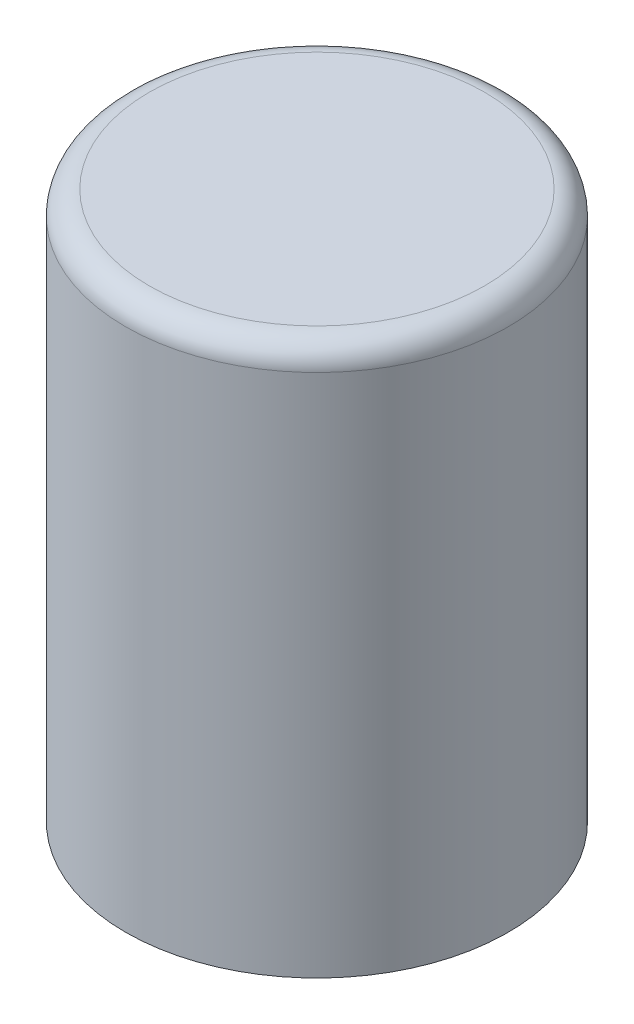
ISO-10303-21;
HEADER;
FILE_DESCRIPTION(('STEP AP214'),'2;1');
FILE_NAME('part.step','',(''),(''),'','','');
FILE_SCHEMA(('AUTOMOTIVE_DESIGN { 1 0 10303 214 1 1 1 1 }'));
ENDSEC;
DATA;
#1=APPLICATION_CONTEXT('core data for automotive mechanical design processes');
#2=APPLICATION_PROTOCOL_DEFINITION('international standard','automotive_design',2000,#1);
#3=PRODUCT_CONTEXT('',#1,'mechanical');
#4=PRODUCT('Part','Part','',(#3));
#5=PRODUCT_RELATED_PRODUCT_CATEGORY('part','',(#4));
#6=PRODUCT_DEFINITION_FORMATION('','',#4);
#7=PRODUCT_DEFINITION_CONTEXT('part definition',#1,'design');
#8=PRODUCT_DEFINITION('design','',#6,#7);
#9=PRODUCT_DEFINITION_SHAPE('','',#8);
#10=(LENGTH_UNIT() NAMED_UNIT(*) SI_UNIT(.MILLI.,.METRE.));
#11=(NAMED_UNIT(*) PLANE_ANGLE_UNIT() SI_UNIT($,.RADIAN.));
#12=(NAMED_UNIT(*) SI_UNIT($,.STERADIAN.) SOLID_ANGLE_UNIT());
#13=UNCERTAINTY_MEASURE_WITH_UNIT(LENGTH_MEASURE(1.E-05),#10,'distance_accuracy_value','');
#14=(GEOMETRIC_REPRESENTATION_CONTEXT(3) GLOBAL_UNCERTAINTY_ASSIGNED_CONTEXT((#13)) GLOBAL_UNIT_ASSIGNED_CONTEXT((#10,
#11,#12)) REPRESENTATION_CONTEXT('',''));
#15=CARTESIAN_POINT('',(0.,0.,0.));
#16=DIRECTION('',(0.,0.,1.));
#17=DIRECTION('',(1.,0.,0.));
#18=AXIS2_PLACEMENT_3D('',#15,#16,#17);
#19=CARTESIAN_POINT('',(-25.67481430058,15.547980609798,14.275230848536));
#20=DIRECTION('',(0.,1.,0.));
#21=DIRECTION('',(0.,0.,1.));
#22=AXIS2_PLACEMENT_3D('',#19,#20,#21);
#23=PLANE('',#22);
#24=CARTESIAN_POINT('',(-25.67481430058,15.547980609798,14.275230848536));
#25=DIRECTION('',(0.,-1.,0.));
#26=DIRECTION('',(0.,0.,-1.));
#27=AXIS2_PLACEMENT_3D('',#24,#25,#26);
#28=CIRCLE('',#27,3.55);
#29=CARTESIAN_POINT('',(-25.67481430058,15.547980609798,10.725230848536));
#30=VERTEX_POINT('',#29);
#31=CARTESIAN_POINT('',(-25.67481430058,15.547980609798,17.825230848536));
#32=VERTEX_POINT('',#31);
#33=EDGE_CURVE('E40',#30,#32,#28,.T.);
#34=ORIENTED_EDGE('',*,*,#33,.F.);
#35=CARTESIAN_POINT('',(-25.67481430058,15.547980609798,14.275230848536));
#36=DIRECTION('',(0.,-1.,0.));
#37=DIRECTION('',(0.,0.,1.));
#38=AXIS2_PLACEMENT_3D('',#35,#36,#37);
#39=CIRCLE('',#38,3.55);
#40=EDGE_CURVE('E34',#32,#30,#39,.T.);
#41=ORIENTED_EDGE('',*,*,#40,.F.);
#42=EDGE_LOOP('',(#34,#41));
#43=FACE_BOUND('',#42,.T.);
#44=ADVANCED_FACE('F17',(#43),#23,.T.);
#45=CARTESIAN_POINT('',(-25.67481430058,15.047980609798,14.275230848536));
#46=DIRECTION('',(0.,1.,0.));
#47=DIRECTION('',(0.,0.,1.));
#48=AXIS2_PLACEMENT_3D('',#45,#46,#47);
#49=TOROIDAL_SURFACE('',#48,3.55,0.5);
#50=ORIENTED_EDGE('',*,*,#40,.T.);
#51=ORIENTED_EDGE('',*,*,#33,.T.);
#52=EDGE_LOOP('',(#50,#51));
#53=FACE_BOUND('',#52,.T.);
#54=CARTESIAN_POINT('',(-25.67481430058,15.047980609798,14.275230848536));
#55=DIRECTION('',(0.,1.,0.));
#56=DIRECTION('',(0.,0.,1.));
#57=AXIS2_PLACEMENT_3D('',#54,#55,#56);
#58=CIRCLE('',#57,4.05);
#59=CARTESIAN_POINT('',(-25.67481430058,15.047980609798,18.325230848536));
#60=VERTEX_POINT('',#59);
#61=EDGE_CURVE('E27',#60,#60,#58,.F.);
#62=ORIENTED_EDGE('',*,*,#61,.F.);
#63=EDGE_LOOP('',(#62));
#64=FACE_BOUND('',#63,.T.);
#65=ADVANCED_FACE('F38',(#53,#64),#49,.T.);
#66=CARTESIAN_POINT('',(-25.67481430058,3.947980609798,14.275230848536));
#67=DIRECTION('',(0.,1.,0.));
#68=DIRECTION('',(0.,0.,1.));
#69=AXIS2_PLACEMENT_3D('',#66,#67,#68);
#70=PLANE('',#69);
#71=CARTESIAN_POINT('',(-25.67481430058,3.947980609798,14.275230848536));
#72=DIRECTION('',(0.,1.,0.));
#73=DIRECTION('',(0.,0.,1.));
#74=AXIS2_PLACEMENT_3D('',#71,#72,#73);
#75=CIRCLE('',#74,4.05);
#76=CARTESIAN_POINT('',(-25.67481430058,3.947980609798,18.325230848536));
#77=VERTEX_POINT('',#76);
#78=EDGE_CURVE('E11',#77,#77,#75,.T.);
#79=ORIENTED_EDGE('',*,*,#78,.F.);
#80=EDGE_LOOP('',(#79));
#81=FACE_BOUND('',#80,.T.);
#82=ADVANCED_FACE('F73',(#81),#70,.F.);
#83=CARTESIAN_POINT('',(-25.67481430058,15.547980609798,14.275230848536));
#84=DIRECTION('',(0.,1.,0.));
#85=DIRECTION('',(0.,0.,1.));
#86=AXIS2_PLACEMENT_3D('',#83,#84,#85);
#87=CYLINDRICAL_SURFACE('',#86,4.05);
#88=ORIENTED_EDGE('',*,*,#78,.T.);
#89=EDGE_LOOP('',(#88));
#90=FACE_BOUND('',#89,.T.);
#91=ORIENTED_EDGE('',*,*,#61,.T.);
#92=EDGE_LOOP('',(#91));
#93=FACE_BOUND('',#92,.T.);
#94=ADVANCED_FACE('F77',(#90,#93),#87,.T.);
#95=CLOSED_SHELL('',(#44,#65,#82,#94));
#96=MANIFOLD_SOLID_BREP('B1',#95);
#97=ADVANCED_BREP_SHAPE_REPRESENTATION('',(#18,#96),#14);
#98=SHAPE_DEFINITION_REPRESENTATION(#9,#97);
ENDSEC;
END-ISO-10303-21;
